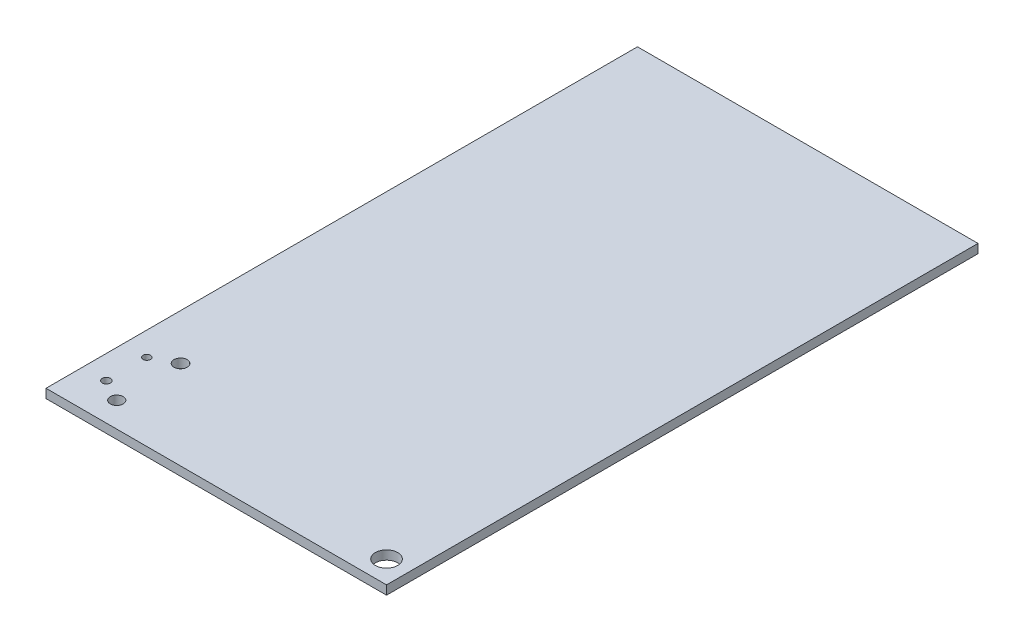
ISO-10303-21;
HEADER;
FILE_DESCRIPTION(('STEP AP214'),'2;1');
FILE_NAME('part.step','',(''),(''),'','','');
FILE_SCHEMA(('AUTOMOTIVE_DESIGN { 1 0 10303 214 1 1 1 1 }'));
ENDSEC;
DATA;
#1=APPLICATION_CONTEXT('core data for automotive mechanical design processes');
#2=APPLICATION_PROTOCOL_DEFINITION('international standard','automotive_design',2000,#1);
#3=PRODUCT_CONTEXT('',#1,'mechanical');
#4=PRODUCT('Part','Part','',(#3));
#5=PRODUCT_RELATED_PRODUCT_CATEGORY('part','',(#4));
#6=PRODUCT_DEFINITION_FORMATION('','',#4);
#7=PRODUCT_DEFINITION_CONTEXT('part definition',#1,'design');
#8=PRODUCT_DEFINITION('design','',#6,#7);
#9=PRODUCT_DEFINITION_SHAPE('','',#8);
#10=(LENGTH_UNIT() NAMED_UNIT(*) SI_UNIT(.MILLI.,.METRE.));
#11=(NAMED_UNIT(*) PLANE_ANGLE_UNIT() SI_UNIT($,.RADIAN.));
#12=(NAMED_UNIT(*) SI_UNIT($,.STERADIAN.) SOLID_ANGLE_UNIT());
#13=UNCERTAINTY_MEASURE_WITH_UNIT(LENGTH_MEASURE(1.E-05),#10,'distance_accuracy_value','');
#14=(GEOMETRIC_REPRESENTATION_CONTEXT(3) GLOBAL_UNCERTAINTY_ASSIGNED_CONTEXT((#13)) GLOBAL_UNIT_ASSIGNED_CONTEXT((#10,
#11,#12)) REPRESENTATION_CONTEXT('',''));
#15=CARTESIAN_POINT('',(0.,0.,0.));
#16=DIRECTION('',(0.,0.,1.));
#17=DIRECTION('',(1.,0.,0.));
#18=AXIS2_PLACEMENT_3D('',#15,#16,#17);
#19=CARTESIAN_POINT('',(0.,1.,0.));
#20=DIRECTION('',(1.,0.,0.));
#21=DIRECTION('',(0.,0.,-1.));
#22=AXIS2_PLACEMENT_3D('',#19,#20,#21);
#23=PLANE('',#22);
#24=DIRECTION('',(0.,0.,1.));
#25=VECTOR('',#24,1.);
#26=CARTESIAN_POINT('',(0.,0.,0.));
#27=LINE('',#26,#25);
#28=CARTESIAN_POINT('',(0.,0.,-66.));
#29=VERTEX_POINT('',#28);
#30=CARTESIAN_POINT('',(0.,0.,0.));
#31=VERTEX_POINT('',#30);
#32=EDGE_CURVE('E99',#29,#31,#27,.T.);
#33=ORIENTED_EDGE('',*,*,#32,.T.);
#34=DIRECTION('',(0.,-1.,0.));
#35=VECTOR('',#34,1.);
#36=CARTESIAN_POINT('',(0.,1.,0.));
#37=LINE('',#36,#35);
#38=CARTESIAN_POINT('',(0.,1.,0.));
#39=VERTEX_POINT('',#38);
#40=EDGE_CURVE('E11',#39,#31,#37,.T.);
#41=ORIENTED_EDGE('',*,*,#40,.F.);
#42=DIRECTION('',(0.,0.,1.));
#43=VECTOR('',#42,1.);
#44=CARTESIAN_POINT('',(0.,1.,0.));
#45=LINE('',#44,#43);
#46=CARTESIAN_POINT('',(0.,1.,-66.));
#47=VERTEX_POINT('',#46);
#48=EDGE_CURVE('E87',#47,#39,#45,.T.);
#49=ORIENTED_EDGE('',*,*,#48,.F.);
#50=DIRECTION('',(0.,-1.,0.));
#51=VECTOR('',#50,1.);
#52=CARTESIAN_POINT('',(0.,1.,-66.));
#53=LINE('',#52,#51);
#54=EDGE_CURVE('E95',#47,#29,#53,.T.);
#55=ORIENTED_EDGE('',*,*,#54,.T.);
#56=EDGE_LOOP('',(#33,#41,#49,#55));
#57=FACE_BOUND('',#56,.T.);
#58=ADVANCED_FACE('F36',(#57),#23,.F.);
#59=CARTESIAN_POINT('',(0.,1.,0.));
#60=DIRECTION('',(0.,0.,-1.));
#61=DIRECTION('',(-1.,0.,0.));
#62=AXIS2_PLACEMENT_3D('',#59,#60,#61);
#63=PLANE('',#62);
#64=DIRECTION('',(1.,0.,0.));
#65=VECTOR('',#64,1.);
#66=CARTESIAN_POINT('',(0.,0.,0.));
#67=LINE('',#66,#65);
#68=CARTESIAN_POINT('',(38.,0.,0.));
#69=VERTEX_POINT('',#68);
#70=EDGE_CURVE('E91',#31,#69,#67,.T.);
#71=ORIENTED_EDGE('',*,*,#70,.T.);
#72=DIRECTION('',(0.,-1.,0.));
#73=VECTOR('',#72,1.);
#74=CARTESIAN_POINT('',(38.,1.,0.));
#75=LINE('',#74,#73);
#76=CARTESIAN_POINT('',(38.,1.,0.));
#77=VERTEX_POINT('',#76);
#78=EDGE_CURVE('E44',#77,#69,#75,.T.);
#79=ORIENTED_EDGE('',*,*,#78,.F.);
#80=DIRECTION('',(1.,0.,0.));
#81=VECTOR('',#80,1.);
#82=CARTESIAN_POINT('',(0.,1.,0.));
#83=LINE('',#82,#81);
#84=EDGE_CURVE('E82',#39,#77,#83,.T.);
#85=ORIENTED_EDGE('',*,*,#84,.F.);
#86=ORIENTED_EDGE('',*,*,#40,.T.);
#87=EDGE_LOOP('',(#71,#79,#85,#86));
#88=FACE_BOUND('',#87,.T.);
#89=ADVANCED_FACE('F90',(#88),#63,.F.);
#90=CARTESIAN_POINT('',(38.,1.,0.));
#91=DIRECTION('',(-1.,0.,0.));
#92=DIRECTION('',(0.,0.,1.));
#93=AXIS2_PLACEMENT_3D('',#90,#91,#92);
#94=PLANE('',#93);
#95=DIRECTION('',(0.,0.,-1.));
#96=VECTOR('',#95,1.);
#97=CARTESIAN_POINT('',(38.,0.,0.));
#98=LINE('',#97,#96);
#99=CARTESIAN_POINT('',(38.,0.,-66.));
#100=VERTEX_POINT('',#99);
#101=EDGE_CURVE('E69',#69,#100,#98,.T.);
#102=ORIENTED_EDGE('',*,*,#101,.T.);
#103=DIRECTION('',(0.,-1.,0.));
#104=VECTOR('',#103,1.);
#105=CARTESIAN_POINT('',(38.,1.,-66.));
#106=LINE('',#105,#104);
#107=CARTESIAN_POINT('',(38.,1.,-66.));
#108=VERTEX_POINT('',#107);
#109=EDGE_CURVE('E92',#108,#100,#106,.T.);
#110=ORIENTED_EDGE('',*,*,#109,.F.);
#111=DIRECTION('',(0.,0.,-1.));
#112=VECTOR('',#111,1.);
#113=CARTESIAN_POINT('',(38.,1.,0.));
#114=LINE('',#113,#112);
#115=EDGE_CURVE('E85',#77,#108,#114,.T.);
#116=ORIENTED_EDGE('',*,*,#115,.F.);
#117=ORIENTED_EDGE('',*,*,#78,.T.);
#118=EDGE_LOOP('',(#102,#110,#116,#117));
#119=FACE_BOUND('',#118,.T.);
#120=ADVANCED_FACE('F93',(#119),#94,.F.);
#121=CARTESIAN_POINT('',(0.,1.,-66.));
#122=DIRECTION('',(0.,0.,1.));
#123=DIRECTION('',(1.,0.,0.));
#124=AXIS2_PLACEMENT_3D('',#121,#122,#123);
#125=PLANE('',#124);
#126=DIRECTION('',(-1.,0.,0.));
#127=VECTOR('',#126,1.);
#128=CARTESIAN_POINT('',(0.,0.,-66.));
#129=LINE('',#128,#127);
#130=EDGE_CURVE('E75',#100,#29,#129,.T.);
#131=ORIENTED_EDGE('',*,*,#130,.T.);
#132=ORIENTED_EDGE('',*,*,#54,.F.);
#133=DIRECTION('',(-1.,0.,0.));
#134=VECTOR('',#133,1.);
#135=CARTESIAN_POINT('',(0.,1.,-66.));
#136=LINE('',#135,#134);
#137=EDGE_CURVE('E52',#108,#47,#136,.T.);
#138=ORIENTED_EDGE('',*,*,#137,.F.);
#139=ORIENTED_EDGE('',*,*,#109,.T.);
#140=EDGE_LOOP('',(#131,#132,#138,#139));
#141=FACE_BOUND('',#140,.T.);
#142=ADVANCED_FACE('F107',(#141),#125,.F.);
#143=CARTESIAN_POINT('',(0.,1.,0.));
#144=DIRECTION('',(0.,-1.,0.));
#145=DIRECTION('',(0.,0.,-1.));
#146=AXIS2_PLACEMENT_3D('',#143,#144,#145);
#147=PLANE('',#146);
#148=CARTESIAN_POINT('',(2.6380168870094,1.,-8.61328299587862));
#149=DIRECTION('',(0.,1.,0.));
#150=DIRECTION('',(0.,0.,1.));
#151=AXIS2_PLACEMENT_3D('',#148,#149,#150);
#152=CIRCLE('',#151,0.409961782601748);
#153=CARTESIAN_POINT('',(2.6380168870094,1.,-8.20332121327687));
#154=VERTEX_POINT('',#153);
#155=EDGE_CURVE('E137',#154,#154,#152,.T.);
#156=ORIENTED_EDGE('',*,*,#155,.F.);
#157=EDGE_LOOP('',(#156));
#158=FACE_BOUND('',#157,.T.);
#159=CARTESIAN_POINT('',(5.10756043364891,1.,-9.90998850993152));
#160=DIRECTION('',(0.,1.,0.));
#161=DIRECTION('',(0.,0.,1.));
#162=AXIS2_PLACEMENT_3D('',#159,#160,#161);
#163=CIRCLE('',#162,0.739914172699115);
#164=CARTESIAN_POINT('',(5.10756043364891,1.,-9.17007433723241));
#165=VERTEX_POINT('',#164);
#166=EDGE_CURVE('E131',#165,#165,#163,.T.);
#167=ORIENTED_EDGE('',*,*,#166,.F.);
#168=EDGE_LOOP('',(#167));
#169=FACE_BOUND('',#168,.T.);
#170=CARTESIAN_POINT('',(5.10756043364891,1.,-2.78516611583102));
#171=DIRECTION('',(0.,1.,0.));
#172=DIRECTION('',(0.,0.,1.));
#173=AXIS2_PLACEMENT_3D('',#170,#171,#172);
#174=CIRCLE('',#173,0.716276254767245);
#175=CARTESIAN_POINT('',(5.10756043364891,1.,-2.06888986106377));
#176=VERTEX_POINT('',#175);
#177=EDGE_CURVE('E125',#176,#176,#174,.T.);
#178=ORIENTED_EDGE('',*,*,#177,.F.);
#179=EDGE_LOOP('',(#178));
#180=FACE_BOUND('',#179,.T.);
#181=CARTESIAN_POINT('',(2.6380168870094,1.,-4.0987726592735));
#182=DIRECTION('',(0.,1.,0.));
#183=DIRECTION('',(0.,0.,1.));
#184=AXIS2_PLACEMENT_3D('',#181,#182,#183);
#185=CIRCLE('',#184,0.45683193667654);
#186=CARTESIAN_POINT('',(2.6380168870094,1.,-3.64194072259696));
#187=VERTEX_POINT('',#186);
#188=EDGE_CURVE('E119',#187,#187,#185,.T.);
#189=ORIENTED_EDGE('',*,*,#188,.F.);
#190=EDGE_LOOP('',(#189));
#191=FACE_BOUND('',#190,.T.);
#192=CARTESIAN_POINT('',(35.5,1.,-2.5));
#193=DIRECTION('',(0.,1.,0.));
#194=DIRECTION('',(0.,0.,1.));
#195=AXIS2_PLACEMENT_3D('',#192,#193,#194);
#196=CIRCLE('',#195,1.25);
#197=CARTESIAN_POINT('',(35.5,1.,-1.25));
#198=VERTEX_POINT('',#197);
#199=EDGE_CURVE('E113',#198,#198,#196,.T.);
#200=ORIENTED_EDGE('',*,*,#199,.F.);
#201=EDGE_LOOP('',(#200));
#202=FACE_BOUND('',#201,.T.);
#203=ORIENTED_EDGE('',*,*,#48,.T.);
#204=ORIENTED_EDGE('',*,*,#84,.T.);
#205=ORIENTED_EDGE('',*,*,#115,.T.);
#206=ORIENTED_EDGE('',*,*,#137,.T.);
#207=EDGE_LOOP('',(#203,#204,#205,#206));
#208=FACE_BOUND('',#207,.T.);
#209=ADVANCED_FACE('F83',(#158,#169,#180,#191,#202,#208),#147,.F.);
#210=CARTESIAN_POINT('',(0.,0.,0.));
#211=DIRECTION('',(0.,-1.,0.));
#212=DIRECTION('',(0.,0.,-1.));
#213=AXIS2_PLACEMENT_3D('',#210,#211,#212);
#214=PLANE('',#213);
#215=CARTESIAN_POINT('',(2.6380168870094,0.,-8.61328299587862));
#216=DIRECTION('',(0.,1.,0.));
#217=DIRECTION('',(0.,0.,1.));
#218=AXIS2_PLACEMENT_3D('',#215,#216,#217);
#219=CIRCLE('',#218,0.409961782601748);
#220=CARTESIAN_POINT('',(2.6380168870094,0.,-8.20332121327687));
#221=VERTEX_POINT('',#220);
#222=EDGE_CURVE('E122',#221,#221,#219,.T.);
#223=ORIENTED_EDGE('',*,*,#222,.T.);
#224=EDGE_LOOP('',(#223));
#225=FACE_BOUND('',#224,.T.);
#226=CARTESIAN_POINT('',(5.10756043364891,0.,-9.90998850993152));
#227=DIRECTION('',(0.,1.,0.));
#228=DIRECTION('',(0.,0.,1.));
#229=AXIS2_PLACEMENT_3D('',#226,#227,#228);
#230=CIRCLE('',#229,0.739914172699115);
#231=CARTESIAN_POINT('',(5.10756043364891,0.,-9.17007433723241));
#232=VERTEX_POINT('',#231);
#233=EDGE_CURVE('E134',#232,#232,#230,.T.);
#234=ORIENTED_EDGE('',*,*,#233,.T.);
#235=EDGE_LOOP('',(#234));
#236=FACE_BOUND('',#235,.T.);
#237=CARTESIAN_POINT('',(5.10756043364891,0.,-2.78516611583102));
#238=DIRECTION('',(0.,1.,0.));
#239=DIRECTION('',(0.,0.,1.));
#240=AXIS2_PLACEMENT_3D('',#237,#238,#239);
#241=CIRCLE('',#240,0.716276254767245);
#242=CARTESIAN_POINT('',(5.10756043364891,0.,-2.06888986106377));
#243=VERTEX_POINT('',#242);
#244=EDGE_CURVE('E128',#243,#243,#241,.T.);
#245=ORIENTED_EDGE('',*,*,#244,.T.);
#246=EDGE_LOOP('',(#245));
#247=FACE_BOUND('',#246,.T.);
#248=CARTESIAN_POINT('',(2.6380168870094,0.,-4.0987726592735));
#249=DIRECTION('',(0.,1.,0.));
#250=DIRECTION('',(0.,0.,1.));
#251=AXIS2_PLACEMENT_3D('',#248,#249,#250);
#252=CIRCLE('',#251,0.45683193667654);
#253=CARTESIAN_POINT('',(2.6380168870094,0.,-3.64194072259696));
#254=VERTEX_POINT('',#253);
#255=EDGE_CURVE('E116',#254,#254,#252,.T.);
#256=ORIENTED_EDGE('',*,*,#255,.T.);
#257=EDGE_LOOP('',(#256));
#258=FACE_BOUND('',#257,.T.);
#259=CARTESIAN_POINT('',(35.5,0.,-2.5));
#260=DIRECTION('',(0.,1.,0.));
#261=DIRECTION('',(0.,0.,1.));
#262=AXIS2_PLACEMENT_3D('',#259,#260,#261);
#263=CIRCLE('',#262,1.25);
#264=CARTESIAN_POINT('',(35.5,0.,-1.25));
#265=VERTEX_POINT('',#264);
#266=EDGE_CURVE('E102',#265,#265,#263,.T.);
#267=ORIENTED_EDGE('',*,*,#266,.T.);
#268=EDGE_LOOP('',(#267));
#269=FACE_BOUND('',#268,.T.);
#270=ORIENTED_EDGE('',*,*,#32,.F.);
#271=ORIENTED_EDGE('',*,*,#130,.F.);
#272=ORIENTED_EDGE('',*,*,#101,.F.);
#273=ORIENTED_EDGE('',*,*,#70,.F.);
#274=EDGE_LOOP('',(#270,#271,#272,#273));
#275=FACE_BOUND('',#274,.T.);
#276=ADVANCED_FACE('F110',(#225,#236,#247,#258,#269,#275),#214,.T.);
#277=CARTESIAN_POINT('',(35.5,0.,-2.5));
#278=DIRECTION('',(0.,1.,0.));
#279=DIRECTION('',(0.,0.,1.));
#280=AXIS2_PLACEMENT_3D('',#277,#278,#279);
#281=CYLINDRICAL_SURFACE('',#280,1.25);
#282=ORIENTED_EDGE('',*,*,#266,.F.);
#283=EDGE_LOOP('',(#282));
#284=FACE_BOUND('',#283,.T.);
#285=ORIENTED_EDGE('',*,*,#199,.T.);
#286=EDGE_LOOP('',(#285));
#287=FACE_BOUND('',#286,.T.);
#288=ADVANCED_FACE('F163',(#284,#287),#281,.F.);
#289=CARTESIAN_POINT('',(2.6380168870094,0.,-4.0987726592735));
#290=DIRECTION('',(0.,1.,0.));
#291=DIRECTION('',(0.,0.,1.));
#292=AXIS2_PLACEMENT_3D('',#289,#290,#291);
#293=CYLINDRICAL_SURFACE('',#292,0.45683193667654);
#294=ORIENTED_EDGE('',*,*,#255,.F.);
#295=EDGE_LOOP('',(#294));
#296=FACE_BOUND('',#295,.T.);
#297=ORIENTED_EDGE('',*,*,#188,.T.);
#298=EDGE_LOOP('',(#297));
#299=FACE_BOUND('',#298,.T.);
#300=ADVANCED_FACE('F165',(#296,#299),#293,.F.);
#301=CARTESIAN_POINT('',(5.10756043364891,0.,-2.78516611583102));
#302=DIRECTION('',(0.,1.,0.));
#303=DIRECTION('',(0.,0.,1.));
#304=AXIS2_PLACEMENT_3D('',#301,#302,#303);
#305=CYLINDRICAL_SURFACE('',#304,0.716276254767245);
#306=ORIENTED_EDGE('',*,*,#244,.F.);
#307=EDGE_LOOP('',(#306));
#308=FACE_BOUND('',#307,.T.);
#309=ORIENTED_EDGE('',*,*,#177,.T.);
#310=EDGE_LOOP('',(#309));
#311=FACE_BOUND('',#310,.T.);
#312=ADVANCED_FACE('F172',(#308,#311),#305,.F.);
#313=CARTESIAN_POINT('',(5.10756043364891,0.,-9.90998850993152));
#314=DIRECTION('',(0.,1.,0.));
#315=DIRECTION('',(0.,0.,1.));
#316=AXIS2_PLACEMENT_3D('',#313,#314,#315);
#317=CYLINDRICAL_SURFACE('',#316,0.739914172699115);
#318=ORIENTED_EDGE('',*,*,#233,.F.);
#319=EDGE_LOOP('',(#318));
#320=FACE_BOUND('',#319,.T.);
#321=ORIENTED_EDGE('',*,*,#166,.T.);
#322=EDGE_LOOP('',(#321));
#323=FACE_BOUND('',#322,.T.);
#324=ADVANCED_FACE('F148',(#320,#323),#317,.F.);
#325=CARTESIAN_POINT('',(2.6380168870094,0.,-8.61328299587862));
#326=DIRECTION('',(0.,1.,0.));
#327=DIRECTION('',(0.,0.,1.));
#328=AXIS2_PLACEMENT_3D('',#325,#326,#327);
#329=CYLINDRICAL_SURFACE('',#328,0.409961782601748);
#330=ORIENTED_EDGE('',*,*,#222,.F.);
#331=EDGE_LOOP('',(#330));
#332=FACE_BOUND('',#331,.T.);
#333=ORIENTED_EDGE('',*,*,#155,.T.);
#334=EDGE_LOOP('',(#333));
#335=FACE_BOUND('',#334,.T.);
#336=ADVANCED_FACE('F145',(#332,#335),#329,.F.);
#337=CLOSED_SHELL('',(#58,#89,#120,#142,#209,#276,#288,#300,#312,#324,#336));
#338=MANIFOLD_SOLID_BREP('B2',#337);
#339=ADVANCED_BREP_SHAPE_REPRESENTATION('',(#18,#338),#14);
#340=SHAPE_DEFINITION_REPRESENTATION(#9,#339);
ENDSEC;
END-ISO-10303-21;
